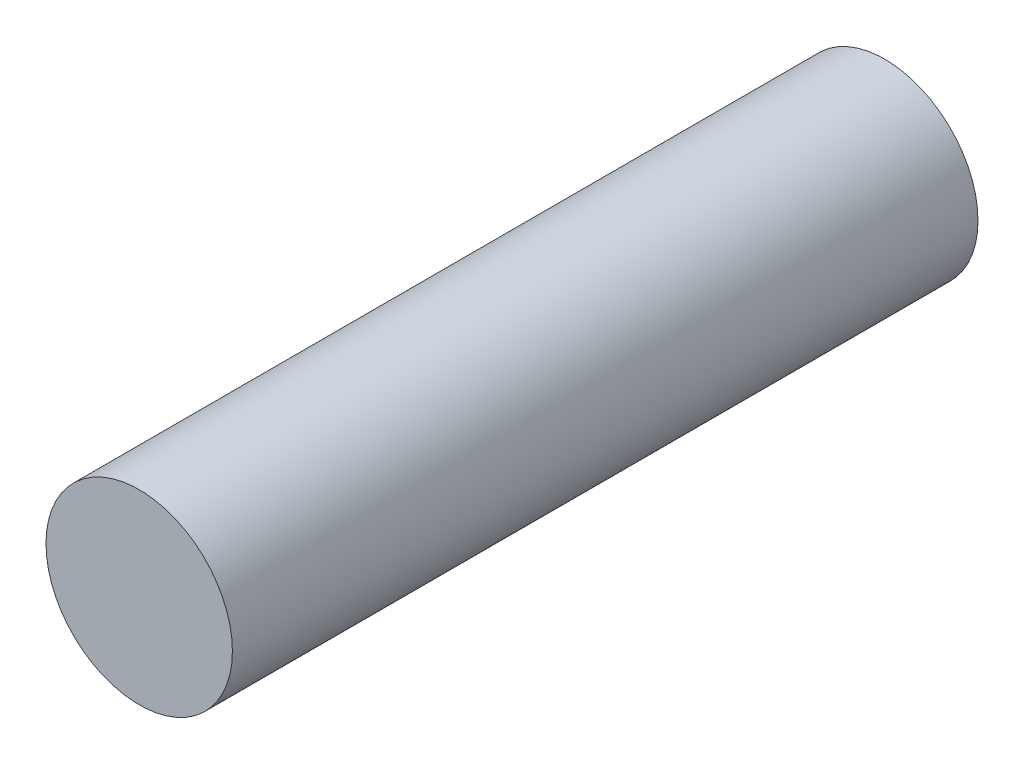
ISO-10303-21;
HEADER;
FILE_DESCRIPTION(('STEP AP214'),'2;1');
FILE_NAME('part.step','',(''),(''),'','','');
FILE_SCHEMA(('AUTOMOTIVE_DESIGN { 1 0 10303 214 1 1 1 1 }'));
ENDSEC;
DATA;
#1=APPLICATION_CONTEXT('core data for automotive mechanical design processes');
#2=APPLICATION_PROTOCOL_DEFINITION('international standard','automotive_design',2000,#1);
#3=PRODUCT_CONTEXT('',#1,'mechanical');
#4=PRODUCT('Part','Part','',(#3));
#5=PRODUCT_RELATED_PRODUCT_CATEGORY('part','',(#4));
#6=PRODUCT_DEFINITION_FORMATION('','',#4);
#7=PRODUCT_DEFINITION_CONTEXT('part definition',#1,'design');
#8=PRODUCT_DEFINITION('design','',#6,#7);
#9=PRODUCT_DEFINITION_SHAPE('','',#8);
#10=(LENGTH_UNIT() NAMED_UNIT(*) SI_UNIT(.MILLI.,.METRE.));
#11=(NAMED_UNIT(*) PLANE_ANGLE_UNIT() SI_UNIT($,.RADIAN.));
#12=(NAMED_UNIT(*) SI_UNIT($,.STERADIAN.) SOLID_ANGLE_UNIT());
#13=UNCERTAINTY_MEASURE_WITH_UNIT(LENGTH_MEASURE(1.E-05),#10,'distance_accuracy_value','');
#14=(GEOMETRIC_REPRESENTATION_CONTEXT(3) GLOBAL_UNCERTAINTY_ASSIGNED_CONTEXT((#13)) GLOBAL_UNIT_ASSIGNED_CONTEXT((#10,
#11,#12)) REPRESENTATION_CONTEXT('',''));
#15=CARTESIAN_POINT('',(0.,0.,0.));
#16=DIRECTION('',(0.,0.,1.));
#17=DIRECTION('',(1.,0.,0.));
#18=AXIS2_PLACEMENT_3D('',#15,#16,#17);
#19=CARTESIAN_POINT('',(0.,0.,12.));
#20=DIRECTION('',(0.,0.,-1.));
#21=DIRECTION('',(-1.,0.,0.));
#22=AXIS2_PLACEMENT_3D('',#19,#20,#21);
#23=CYLINDRICAL_SURFACE('',#22,1.5);
#24=CARTESIAN_POINT('',(0.,0.,12.));
#25=DIRECTION('',(0.,0.,1.));
#26=DIRECTION('',(1.,0.,0.));
#27=AXIS2_PLACEMENT_3D('',#24,#25,#26);
#28=CIRCLE('',#27,1.5);
#29=CARTESIAN_POINT('',(1.5,0.,12.));
#30=VERTEX_POINT('',#29);
#31=EDGE_CURVE('E10',#30,#30,#28,.T.);
#32=ORIENTED_EDGE('',*,*,#31,.F.);
#33=EDGE_LOOP('',(#32));
#34=FACE_BOUND('',#33,.T.);
#35=CARTESIAN_POINT('',(0.,0.,0.));
#36=DIRECTION('',(0.,0.,1.));
#37=DIRECTION('',(1.,0.,0.));
#38=AXIS2_PLACEMENT_3D('',#35,#36,#37);
#39=CIRCLE('',#38,1.5);
#40=CARTESIAN_POINT('',(1.5,0.,0.));
#41=VERTEX_POINT('',#40);
#42=EDGE_CURVE('E36',#41,#41,#39,.T.);
#43=ORIENTED_EDGE('',*,*,#42,.T.);
#44=EDGE_LOOP('',(#43));
#45=FACE_BOUND('',#44,.T.);
#46=ADVANCED_FACE('F33',(#34,#45),#23,.T.);
#47=CARTESIAN_POINT('',(0.,0.,12.));
#48=DIRECTION('',(0.,0.,1.));
#49=DIRECTION('',(1.,0.,0.));
#50=AXIS2_PLACEMENT_3D('',#47,#48,#49);
#51=PLANE('',#50);
#52=ORIENTED_EDGE('',*,*,#31,.T.);
#53=EDGE_LOOP('',(#52));
#54=FACE_BOUND('',#53,.T.);
#55=ADVANCED_FACE('F48',(#54),#51,.T.);
#56=CARTESIAN_POINT('',(0.,0.,0.));
#57=DIRECTION('',(0.,0.,1.));
#58=DIRECTION('',(1.,0.,0.));
#59=AXIS2_PLACEMENT_3D('',#56,#57,#58);
#60=PLANE('',#59);
#61=ORIENTED_EDGE('',*,*,#42,.F.);
#62=EDGE_LOOP('',(#61));
#63=FACE_BOUND('',#62,.T.);
#64=ADVANCED_FACE('F46',(#63),#60,.F.);
#65=CLOSED_SHELL('',(#46,#55,#64));
#66=MANIFOLD_SOLID_BREP('B2',#65);
#67=ADVANCED_BREP_SHAPE_REPRESENTATION('',(#18,#66),#14);
#68=SHAPE_DEFINITION_REPRESENTATION(#9,#67);
ENDSEC;
END-ISO-10303-21;
